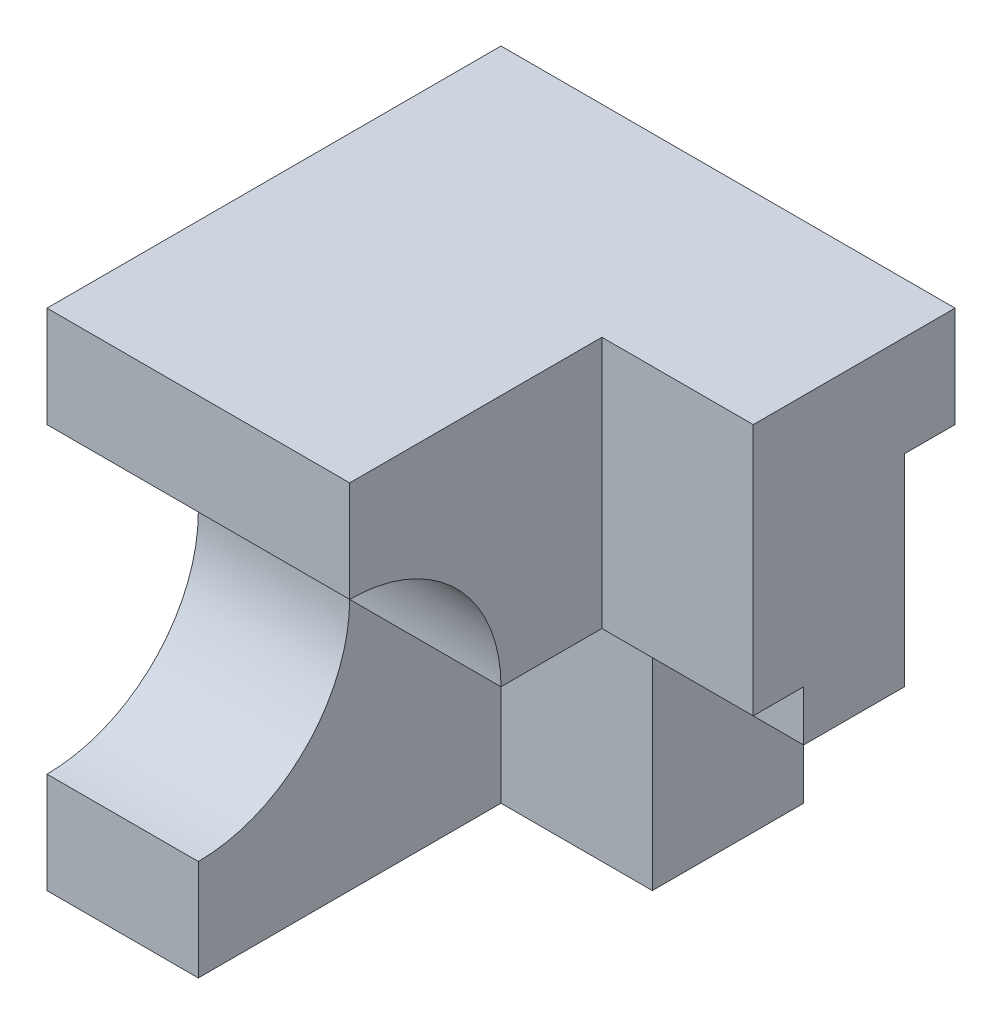
ISO-10303-21;
HEADER;
FILE_DESCRIPTION(('STEP AP214'),'2;1');
FILE_NAME('part.step','',(''),(''),'','','');
FILE_SCHEMA(('AUTOMOTIVE_DESIGN { 1 0 10303 214 1 1 1 1 }'));
ENDSEC;
DATA;
#1=APPLICATION_CONTEXT('core data for automotive mechanical design processes');
#2=APPLICATION_PROTOCOL_DEFINITION('international standard','automotive_design',2000,#1);
#3=PRODUCT_CONTEXT('',#1,'mechanical');
#4=PRODUCT('Part','Part','',(#3));
#5=PRODUCT_RELATED_PRODUCT_CATEGORY('part','',(#4));
#6=PRODUCT_DEFINITION_FORMATION('','',#4);
#7=PRODUCT_DEFINITION_CONTEXT('part definition',#1,'design');
#8=PRODUCT_DEFINITION('design','',#6,#7);
#9=PRODUCT_DEFINITION_SHAPE('','',#8);
#10=(LENGTH_UNIT() NAMED_UNIT(*) SI_UNIT(.MILLI.,.METRE.));
#11=(NAMED_UNIT(*) PLANE_ANGLE_UNIT() SI_UNIT($,.RADIAN.));
#12=(NAMED_UNIT(*) SI_UNIT($,.STERADIAN.) SOLID_ANGLE_UNIT());
#13=UNCERTAINTY_MEASURE_WITH_UNIT(LENGTH_MEASURE(1.E-05),#10,'distance_accuracy_value','');
#14=(GEOMETRIC_REPRESENTATION_CONTEXT(3) GLOBAL_UNCERTAINTY_ASSIGNED_CONTEXT((#13)) GLOBAL_UNIT_ASSIGNED_CONTEXT((#10,
#11,#12)) REPRESENTATION_CONTEXT('',''));
#15=CARTESIAN_POINT('',(0.,0.,0.));
#16=DIRECTION('',(0.,0.,1.));
#17=DIRECTION('',(1.,0.,0.));
#18=AXIS2_PLACEMENT_3D('',#15,#16,#17);
#19=CARTESIAN_POINT('',(9.,0.,-4.5));
#20=DIRECTION('',(0.,0.,1.));
#21=DIRECTION('',(1.,0.,0.));
#22=AXIS2_PLACEMENT_3D('',#19,#20,#21);
#23=PLANE('',#22);
#24=DIRECTION('',(0.,1.,0.));
#25=VECTOR('',#24,1.);
#26=CARTESIAN_POINT('',(6.,0.,-4.5));
#27=LINE('',#26,#25);
#28=CARTESIAN_POINT('',(6.,-5.,-4.5));
#29=VERTEX_POINT('',#28);
#30=CARTESIAN_POINT('',(6.,-3.,-4.5));
#31=VERTEX_POINT('',#30);
#32=EDGE_CURVE('E251',#29,#31,#27,.T.);
#33=ORIENTED_EDGE('',*,*,#32,.F.);
#34=DIRECTION('',(-1.,0.,0.));
#35=VECTOR('',#34,1.);
#36=CARTESIAN_POINT('',(9.,-5.,-4.5));
#37=LINE('',#36,#35);
#38=CARTESIAN_POINT('',(0.,-5.,-4.5));
#39=VERTEX_POINT('',#38);
#40=EDGE_CURVE('E193',#29,#39,#37,.T.);
#41=ORIENTED_EDGE('',*,*,#40,.T.);
#42=DIRECTION('',(0.,1.,0.));
#43=VECTOR('',#42,1.);
#44=CARTESIAN_POINT('',(0.,0.,-4.5));
#45=LINE('',#44,#43);
#46=CARTESIAN_POINT('',(0.,-3.,-4.5));
#47=VERTEX_POINT('',#46);
#48=EDGE_CURVE('E223',#39,#47,#45,.T.);
#49=ORIENTED_EDGE('',*,*,#48,.T.);
#50=DIRECTION('',(-1.,0.,0.));
#51=VECTOR('',#50,1.);
#52=CARTESIAN_POINT('',(9.,-3.,-4.5));
#53=LINE('',#52,#51);
#54=EDGE_CURVE('E194',#31,#47,#53,.T.);
#55=ORIENTED_EDGE('',*,*,#54,.F.);
#56=EDGE_LOOP('',(#33,#41,#49,#55));
#57=FACE_BOUND('',#56,.T.);
#58=ADVANCED_FACE('F35',(#57),#23,.F.);
#59=CARTESIAN_POINT('',(9.,-2.99999999999999,0.));
#60=DIRECTION('',(0.,-1.,0.));
#61=DIRECTION('',(0.,0.,-1.));
#62=AXIS2_PLACEMENT_3D('',#59,#60,#61);
#63=PLANE('',#62);
#64=DIRECTION('',(0.,0.,1.));
#65=VECTOR('',#64,1.);
#66=CARTESIAN_POINT('',(6.,-2.99999999999999,0.));
#67=LINE('',#66,#65);
#68=CARTESIAN_POINT('',(6.,-3.,-3.5));
#69=VERTEX_POINT('',#68);
#70=EDGE_CURVE('E249',#31,#69,#67,.T.);
#71=ORIENTED_EDGE('',*,*,#70,.F.);
#72=ORIENTED_EDGE('',*,*,#54,.T.);
#73=DIRECTION('',(0.,0.,1.));
#74=VECTOR('',#73,1.);
#75=CARTESIAN_POINT('',(0.,-2.99999999999999,0.));
#76=LINE('',#75,#74);
#77=CARTESIAN_POINT('',(0.,-3.,-3.5));
#78=VERTEX_POINT('',#77);
#79=EDGE_CURVE('E220',#47,#78,#76,.T.);
#80=ORIENTED_EDGE('',*,*,#79,.T.);
#81=DIRECTION('',(-1.,0.,0.));
#82=VECTOR('',#81,1.);
#83=CARTESIAN_POINT('',(9.,-3.,-3.5));
#84=LINE('',#83,#82);
#85=EDGE_CURVE('E198',#69,#78,#84,.T.);
#86=ORIENTED_EDGE('',*,*,#85,.F.);
#87=EDGE_LOOP('',(#71,#72,#80,#86));
#88=FACE_BOUND('',#87,.T.);
#89=ADVANCED_FACE('F321',(#88),#63,.F.);
#90=CARTESIAN_POINT('',(9.,0.,-3.5));
#91=DIRECTION('',(0.,0.,1.));
#92=DIRECTION('',(1.,0.,0.));
#93=AXIS2_PLACEMENT_3D('',#90,#91,#92);
#94=PLANE('',#93);
#95=DIRECTION('',(1.,0.,0.));
#96=VECTOR('',#95,1.);
#97=CARTESIAN_POINT('',(6.,-1.,-3.5));
#98=LINE('',#97,#96);
#99=CARTESIAN_POINT('',(6.,-1.,-3.5));
#100=VERTEX_POINT('',#99);
#101=CARTESIAN_POINT('',(9.,-1.,-3.5));
#102=VERTEX_POINT('',#101);
#103=EDGE_CURVE('E240',#100,#102,#98,.T.);
#104=ORIENTED_EDGE('',*,*,#103,.F.);
#105=DIRECTION('',(0.,1.,0.));
#106=VECTOR('',#105,1.);
#107=CARTESIAN_POINT('',(6.,0.,-3.5));
#108=LINE('',#107,#106);
#109=EDGE_CURVE('E241',#69,#100,#108,.T.);
#110=ORIENTED_EDGE('',*,*,#109,.F.);
#111=ORIENTED_EDGE('',*,*,#85,.T.);
#112=DIRECTION('',(0.,1.,0.));
#113=VECTOR('',#112,1.);
#114=CARTESIAN_POINT('',(0.,0.,-3.5));
#115=LINE('',#114,#113);
#116=CARTESIAN_POINT('',(0.,3.,-3.5));
#117=VERTEX_POINT('',#116);
#118=EDGE_CURVE('E217',#78,#117,#115,.T.);
#119=ORIENTED_EDGE('',*,*,#118,.T.);
#120=DIRECTION('',(-1.,0.,0.));
#121=VECTOR('',#120,1.);
#122=CARTESIAN_POINT('',(9.,3.,-3.5));
#123=LINE('',#122,#121);
#124=CARTESIAN_POINT('',(9.,3.,-3.5));
#125=VERTEX_POINT('',#124);
#126=EDGE_CURVE('E200',#125,#117,#123,.T.);
#127=ORIENTED_EDGE('',*,*,#126,.F.);
#128=DIRECTION('',(0.,1.,0.));
#129=VECTOR('',#128,1.);
#130=CARTESIAN_POINT('',(9.,0.,-3.5));
#131=LINE('',#130,#129);
#132=EDGE_CURVE('E100',#102,#125,#131,.T.);
#133=ORIENTED_EDGE('',*,*,#132,.F.);
#134=EDGE_LOOP('',(#104,#110,#111,#119,#127,#133));
#135=FACE_BOUND('',#134,.T.);
#136=ADVANCED_FACE('F325',(#135),#94,.F.);
#137=CARTESIAN_POINT('',(9.,0.,4.5));
#138=DIRECTION('',(0.,0.,1.));
#139=DIRECTION('',(1.,0.,0.));
#140=AXIS2_PLACEMENT_3D('',#137,#138,#139);
#141=PLANE('',#140);
#142=DIRECTION('',(-1.,0.,0.));
#143=VECTOR('',#142,1.);
#144=CARTESIAN_POINT('',(9.,3.,4.5));
#145=LINE('',#144,#143);
#146=CARTESIAN_POINT('',(6.,3.,4.5));
#147=VERTEX_POINT('',#146);
#148=CARTESIAN_POINT('',(0.,3.,4.5));
#149=VERTEX_POINT('',#148);
#150=EDGE_CURVE('E95',#147,#149,#145,.T.);
#151=ORIENTED_EDGE('',*,*,#150,.F.);
#152=DIRECTION('',(0.,-1.,0.));
#153=VECTOR('',#152,1.);
#154=CARTESIAN_POINT('',(6.,0.,4.5));
#155=LINE('',#154,#153);
#156=CARTESIAN_POINT('',(6.,5.,4.5));
#157=VERTEX_POINT('',#156);
#158=EDGE_CURVE('E269',#157,#147,#155,.T.);
#159=ORIENTED_EDGE('',*,*,#158,.F.);
#160=DIRECTION('',(-1.,0.,0.));
#161=VECTOR('',#160,1.);
#162=CARTESIAN_POINT('',(9.,5.,4.5));
#163=LINE('',#162,#161);
#164=CARTESIAN_POINT('',(0.,5.,4.5));
#165=VERTEX_POINT('',#164);
#166=EDGE_CURVE('E88',#157,#165,#163,.T.);
#167=ORIENTED_EDGE('',*,*,#166,.T.);
#168=DIRECTION('',(0.,1.,0.));
#169=VECTOR('',#168,1.);
#170=CARTESIAN_POINT('',(0.,0.,4.5));
#171=LINE('',#170,#169);
#172=EDGE_CURVE('E212',#149,#165,#171,.T.);
#173=ORIENTED_EDGE('',*,*,#172,.F.);
#174=EDGE_LOOP('',(#151,#159,#167,#173));
#175=FACE_BOUND('',#174,.T.);
#176=ADVANCED_FACE('F299',(#175),#141,.T.);
#177=CARTESIAN_POINT('',(9.,0.,0.));
#178=DIRECTION('',(1.,0.,0.));
#179=DIRECTION('',(0.,0.,-1.));
#180=AXIS2_PLACEMENT_3D('',#177,#178,#179);
#181=PLANE('',#180);
#182=DIRECTION('',(0.,0.,1.));
#183=VECTOR('',#182,1.);
#184=CARTESIAN_POINT('',(9.,0.,4.5));
#185=LINE('',#184,#183);
#186=CARTESIAN_POINT('',(9.,0.,-1.5));
#187=VERTEX_POINT('',#186);
#188=CARTESIAN_POINT('',(9.,0.,-0.500000000000001));
#189=VERTEX_POINT('',#188);
#190=EDGE_CURVE('E179',#187,#189,#185,.T.);
#191=ORIENTED_EDGE('',*,*,#190,.F.);
#192=DIRECTION('',(0.,1.,0.));
#193=VECTOR('',#192,1.);
#194=CARTESIAN_POINT('',(9.,-5.,-1.5));
#195=LINE('',#194,#193);
#196=CARTESIAN_POINT('',(9.,-1.,-1.5));
#197=VERTEX_POINT('',#196);
#198=EDGE_CURVE('E287',#197,#187,#195,.T.);
#199=ORIENTED_EDGE('',*,*,#198,.F.);
#200=DIRECTION('',(0.,0.,-1.));
#201=VECTOR('',#200,1.);
#202=CARTESIAN_POINT('',(9.,-1.,0.));
#203=LINE('',#202,#201);
#204=EDGE_CURVE('E244',#197,#102,#203,.T.);
#205=ORIENTED_EDGE('',*,*,#204,.T.);
#206=ORIENTED_EDGE('',*,*,#132,.T.);
#207=DIRECTION('',(0.,0.,1.));
#208=VECTOR('',#207,1.);
#209=CARTESIAN_POINT('',(9.,3.,0.));
#210=LINE('',#209,#208);
#211=CARTESIAN_POINT('',(9.,3.,-4.5));
#212=VERTEX_POINT('',#211);
#213=EDGE_CURVE('E233',#212,#125,#210,.T.);
#214=ORIENTED_EDGE('',*,*,#213,.F.);
#215=DIRECTION('',(0.,1.,0.));
#216=VECTOR('',#215,1.);
#217=CARTESIAN_POINT('',(9.,0.,-4.5));
#218=LINE('',#217,#216);
#219=CARTESIAN_POINT('',(9.,5.,-4.5));
#220=VERTEX_POINT('',#219);
#221=EDGE_CURVE('E52',#212,#220,#218,.T.);
#222=ORIENTED_EDGE('',*,*,#221,.T.);
#223=DIRECTION('',(0.,0.,1.));
#224=VECTOR('',#223,1.);
#225=CARTESIAN_POINT('',(9.,5.,0.));
#226=LINE('',#225,#224);
#227=CARTESIAN_POINT('',(9.,5.,-0.500000000000001));
#228=VERTEX_POINT('',#227);
#229=EDGE_CURVE('E209',#220,#228,#226,.T.);
#230=ORIENTED_EDGE('',*,*,#229,.T.);
#231=DIRECTION('',(0.,1.,0.));
#232=VECTOR('',#231,1.);
#233=CARTESIAN_POINT('',(9.,0.,-0.500000000000001));
#234=LINE('',#233,#232);
#235=EDGE_CURVE('E243',#189,#228,#234,.T.);
#236=ORIENTED_EDGE('',*,*,#235,.F.);
#237=EDGE_LOOP('',(#191,#199,#205,#206,#214,#222,#230,#236));
#238=FACE_BOUND('',#237,.T.);
#239=ADVANCED_FACE('F332',(#238),#181,.T.);
#240=CARTESIAN_POINT('',(9.,0.,4.5));
#241=DIRECTION('',(-1.,0.,0.));
#242=DIRECTION('',(0.,0.,1.));
#243=AXIS2_PLACEMENT_3D('',#240,#241,#242);
#244=CYLINDRICAL_SURFACE('',#243,3.);
#245=DIRECTION('',(-1.,0.,0.));
#246=VECTOR('',#245,1.);
#247=CARTESIAN_POINT('',(9.,0.,1.5));
#248=LINE('',#247,#246);
#249=CARTESIAN_POINT('',(6.,0.,1.5));
#250=VERTEX_POINT('',#249);
#251=CARTESIAN_POINT('',(3.,0.,1.5));
#252=VERTEX_POINT('',#251);
#253=EDGE_CURVE('E279',#250,#252,#248,.T.);
#254=ORIENTED_EDGE('',*,*,#253,.F.);
#255=CARTESIAN_POINT('',(6.,0.,4.5));
#256=DIRECTION('',(1.,0.,0.));
#257=DIRECTION('',(0.,0.,-1.));
#258=AXIS2_PLACEMENT_3D('',#255,#256,#257);
#259=CIRCLE('',#258,3.);
#260=EDGE_CURVE('E262',#147,#250,#259,.F.);
#261=ORIENTED_EDGE('',*,*,#260,.F.);
#262=ORIENTED_EDGE('',*,*,#150,.T.);
#263=CARTESIAN_POINT('',(0.,0.,4.5));
#264=DIRECTION('',(1.,0.,0.));
#265=DIRECTION('',(0.,0.,-1.));
#266=AXIS2_PLACEMENT_3D('',#263,#264,#265);
#267=CIRCLE('',#266,3.);
#268=CARTESIAN_POINT('',(0.,-3.,4.5));
#269=VERTEX_POINT('',#268);
#270=EDGE_CURVE('E229',#269,#149,#267,.T.);
#271=ORIENTED_EDGE('',*,*,#270,.F.);
#272=DIRECTION('',(-1.,0.,0.));
#273=VECTOR('',#272,1.);
#274=CARTESIAN_POINT('',(9.,-3.,4.5));
#275=LINE('',#274,#273);
#276=CARTESIAN_POINT('',(3.,-3.,4.5));
#277=VERTEX_POINT('',#276);
#278=EDGE_CURVE('E11',#277,#269,#275,.T.);
#279=ORIENTED_EDGE('',*,*,#278,.F.);
#280=CARTESIAN_POINT('',(3.,0.,4.5));
#281=DIRECTION('',(-1.,0.,0.));
#282=DIRECTION('',(0.,0.,1.));
#283=AXIS2_PLACEMENT_3D('',#280,#281,#282);
#284=CIRCLE('',#283,3.);
#285=EDGE_CURVE('E175',#252,#277,#284,.T.);
#286=ORIENTED_EDGE('',*,*,#285,.F.);
#287=EDGE_LOOP('',(#254,#261,#262,#271,#279,#286));
#288=FACE_BOUND('',#287,.T.);
#289=ADVANCED_FACE('F37',(#288),#244,.F.);
#290=DIRECTION('',(0.,-1.,0.));
#291=VECTOR('',#290,1.);
#292=CARTESIAN_POINT('',(3.,-5.,4.5));
#293=LINE('',#292,#291);
#294=CARTESIAN_POINT('',(3.,-5.,4.5));
#295=VERTEX_POINT('',#294);
#296=EDGE_CURVE('E167',#277,#295,#293,.T.);
#297=ORIENTED_EDGE('',*,*,#296,.F.);
#298=ORIENTED_EDGE('',*,*,#278,.T.);
#299=CARTESIAN_POINT('',(0.,-5.,4.5));
#300=VERTEX_POINT('',#299);
#301=EDGE_CURVE('E191',#300,#269,#171,.T.);
#302=ORIENTED_EDGE('',*,*,#301,.F.);
#303=DIRECTION('',(-1.,0.,0.));
#304=VECTOR('',#303,1.);
#305=CARTESIAN_POINT('',(9.,-5.,4.5));
#306=LINE('',#305,#304);
#307=EDGE_CURVE('E44',#295,#300,#306,.T.);
#308=ORIENTED_EDGE('',*,*,#307,.F.);
#309=EDGE_LOOP('',(#297,#298,#302,#308));
#310=FACE_BOUND('',#309,.T.);
#311=ADVANCED_FACE('F189',(#310),#141,.T.);
#312=CARTESIAN_POINT('',(9.,-5.,0.));
#313=DIRECTION('',(0.,-1.,0.));
#314=DIRECTION('',(0.,0.,-1.));
#315=AXIS2_PLACEMENT_3D('',#312,#313,#314);
#316=PLANE('',#315);
#317=DIRECTION('',(1.,0.,0.));
#318=VECTOR('',#317,1.);
#319=CARTESIAN_POINT('',(3.,-5.,-1.5));
#320=LINE('',#319,#318);
#321=CARTESIAN_POINT('',(3.,-5.,-1.5));
#322=VERTEX_POINT('',#321);
#323=CARTESIAN_POINT('',(6.,-5.,-1.5));
#324=VERTEX_POINT('',#323);
#325=EDGE_CURVE('E186',#322,#324,#320,.T.);
#326=ORIENTED_EDGE('',*,*,#325,.F.);
#327=DIRECTION('',(0.,0.,-1.));
#328=VECTOR('',#327,1.);
#329=CARTESIAN_POINT('',(3.,-5.,4.5));
#330=LINE('',#329,#328);
#331=EDGE_CURVE('E171',#295,#322,#330,.T.);
#332=ORIENTED_EDGE('',*,*,#331,.F.);
#333=ORIENTED_EDGE('',*,*,#307,.T.);
#334=DIRECTION('',(0.,0.,1.));
#335=VECTOR('',#334,1.);
#336=CARTESIAN_POINT('',(0.,-5.,0.));
#337=LINE('',#336,#335);
#338=EDGE_CURVE('E226',#39,#300,#337,.T.);
#339=ORIENTED_EDGE('',*,*,#338,.F.);
#340=ORIENTED_EDGE('',*,*,#40,.F.);
#341=DIRECTION('',(0.,0.,-1.));
#342=VECTOR('',#341,1.);
#343=CARTESIAN_POINT('',(6.,-5.,0.));
#344=LINE('',#343,#342);
#345=EDGE_CURVE('E253',#324,#29,#344,.T.);
#346=ORIENTED_EDGE('',*,*,#345,.F.);
#347=EDGE_LOOP('',(#326,#332,#333,#339,#340,#346));
#348=FACE_BOUND('',#347,.T.);
#349=ADVANCED_FACE('F182',(#348),#316,.T.);
#350=CARTESIAN_POINT('',(9.,3.,0.));
#351=DIRECTION('',(0.,-1.,0.));
#352=DIRECTION('',(0.,0.,-1.));
#353=AXIS2_PLACEMENT_3D('',#350,#351,#352);
#354=PLANE('',#353);
#355=DIRECTION('',(0.,0.,1.));
#356=VECTOR('',#355,1.);
#357=CARTESIAN_POINT('',(0.,3.,0.));
#358=LINE('',#357,#356);
#359=CARTESIAN_POINT('',(0.,3.,-4.5));
#360=VERTEX_POINT('',#359);
#361=EDGE_CURVE('E214',#360,#117,#358,.T.);
#362=ORIENTED_EDGE('',*,*,#361,.F.);
#363=DIRECTION('',(-1.,0.,0.));
#364=VECTOR('',#363,1.);
#365=CARTESIAN_POINT('',(9.,3.,-4.5));
#366=LINE('',#365,#364);
#367=EDGE_CURVE('E202',#212,#360,#366,.T.);
#368=ORIENTED_EDGE('',*,*,#367,.F.);
#369=ORIENTED_EDGE('',*,*,#213,.T.);
#370=ORIENTED_EDGE('',*,*,#126,.T.);
#371=EDGE_LOOP('',(#362,#368,#369,#370));
#372=FACE_BOUND('',#371,.T.);
#373=ADVANCED_FACE('F355',(#372),#354,.T.);
#374=CARTESIAN_POINT('',(0.,5.,-4.5));
#375=VERTEX_POINT('',#374);
#376=EDGE_CURVE('E213',#360,#375,#45,.T.);
#377=ORIENTED_EDGE('',*,*,#376,.T.);
#378=DIRECTION('',(-1.,0.,0.));
#379=VECTOR('',#378,1.);
#380=CARTESIAN_POINT('',(9.,5.,-4.5));
#381=LINE('',#380,#379);
#382=EDGE_CURVE('E204',#220,#375,#381,.T.);
#383=ORIENTED_EDGE('',*,*,#382,.F.);
#384=ORIENTED_EDGE('',*,*,#221,.F.);
#385=ORIENTED_EDGE('',*,*,#367,.T.);
#386=EDGE_LOOP('',(#377,#383,#384,#385));
#387=FACE_BOUND('',#386,.T.);
#388=ADVANCED_FACE('F347',(#387),#23,.F.);
#389=CARTESIAN_POINT('',(9.,5.,0.));
#390=DIRECTION('',(0.,-1.,0.));
#391=DIRECTION('',(0.,0.,-1.));
#392=AXIS2_PLACEMENT_3D('',#389,#390,#391);
#393=PLANE('',#392);
#394=DIRECTION('',(0.,0.,1.));
#395=VECTOR('',#394,1.);
#396=CARTESIAN_POINT('',(6.,5.,0.));
#397=LINE('',#396,#395);
#398=CARTESIAN_POINT('',(6.,5.,-0.500000000000001));
#399=VERTEX_POINT('',#398);
#400=EDGE_CURVE('E271',#399,#157,#397,.T.);
#401=ORIENTED_EDGE('',*,*,#400,.F.);
#402=DIRECTION('',(1.,0.,0.));
#403=VECTOR('',#402,1.);
#404=CARTESIAN_POINT('',(6.,5.,-0.500000000000001));
#405=LINE('',#404,#403);
#406=EDGE_CURVE('E231',#399,#228,#405,.T.);
#407=ORIENTED_EDGE('',*,*,#406,.T.);
#408=ORIENTED_EDGE('',*,*,#229,.F.);
#409=ORIENTED_EDGE('',*,*,#382,.T.);
#410=DIRECTION('',(0.,0.,1.));
#411=VECTOR('',#410,1.);
#412=CARTESIAN_POINT('',(0.,5.,0.));
#413=LINE('',#412,#411);
#414=EDGE_CURVE('E210',#375,#165,#413,.T.);
#415=ORIENTED_EDGE('',*,*,#414,.T.);
#416=ORIENTED_EDGE('',*,*,#166,.F.);
#417=EDGE_LOOP('',(#401,#407,#408,#409,#415,#416));
#418=FACE_BOUND('',#417,.T.);
#419=ADVANCED_FACE('F301',(#418),#393,.F.);
#420=CARTESIAN_POINT('',(0.,0.,0.));
#421=DIRECTION('',(1.,0.,0.));
#422=DIRECTION('',(0.,0.,-1.));
#423=AXIS2_PLACEMENT_3D('',#420,#421,#422);
#424=PLANE('',#423);
#425=ORIENTED_EDGE('',*,*,#270,.T.);
#426=ORIENTED_EDGE('',*,*,#172,.T.);
#427=ORIENTED_EDGE('',*,*,#414,.F.);
#428=ORIENTED_EDGE('',*,*,#376,.F.);
#429=ORIENTED_EDGE('',*,*,#361,.T.);
#430=ORIENTED_EDGE('',*,*,#118,.F.);
#431=ORIENTED_EDGE('',*,*,#79,.F.);
#432=ORIENTED_EDGE('',*,*,#48,.F.);
#433=ORIENTED_EDGE('',*,*,#338,.T.);
#434=ORIENTED_EDGE('',*,*,#301,.T.);
#435=EDGE_LOOP('',(#425,#426,#427,#428,#429,#430,#431,#432,#433,#434));
#436=FACE_BOUND('',#435,.T.);
#437=ADVANCED_FACE('F307',(#436),#424,.F.);
#438=CARTESIAN_POINT('',(6.,-1.,0.));
#439=DIRECTION('',(0.,-1.,0.));
#440=DIRECTION('',(0.,0.,-1.));
#441=AXIS2_PLACEMENT_3D('',#438,#439,#440);
#442=PLANE('',#441);
#443=ORIENTED_EDGE('',*,*,#204,.F.);
#444=DIRECTION('',(1.,0.,0.));
#445=VECTOR('',#444,1.);
#446=CARTESIAN_POINT('',(6.,-1.,-1.5));
#447=LINE('',#446,#445);
#448=CARTESIAN_POINT('',(6.,-1.,-1.5));
#449=VERTEX_POINT('',#448);
#450=EDGE_CURVE('E238',#449,#197,#447,.T.);
#451=ORIENTED_EDGE('',*,*,#450,.F.);
#452=DIRECTION('',(0.,0.,-1.));
#453=VECTOR('',#452,1.);
#454=CARTESIAN_POINT('',(6.,-1.,0.));
#455=LINE('',#454,#453);
#456=EDGE_CURVE('E246',#449,#100,#455,.T.);
#457=ORIENTED_EDGE('',*,*,#456,.T.);
#458=ORIENTED_EDGE('',*,*,#103,.T.);
#459=EDGE_LOOP('',(#443,#451,#457,#458));
#460=FACE_BOUND('',#459,.T.);
#461=ADVANCED_FACE('F329',(#460),#442,.T.);
#462=CARTESIAN_POINT('',(6.,0.,0.));
#463=DIRECTION('',(1.,0.,0.));
#464=DIRECTION('',(0.,0.,-1.));
#465=AXIS2_PLACEMENT_3D('',#462,#463,#464);
#466=PLANE('',#465);
#467=ORIENTED_EDGE('',*,*,#456,.F.);
#468=DIRECTION('',(0.,-1.,0.));
#469=VECTOR('',#468,1.);
#470=CARTESIAN_POINT('',(6.,0.,-1.5));
#471=LINE('',#470,#469);
#472=EDGE_CURVE('E255',#449,#324,#471,.T.);
#473=ORIENTED_EDGE('',*,*,#472,.T.);
#474=ORIENTED_EDGE('',*,*,#345,.T.);
#475=ORIENTED_EDGE('',*,*,#32,.T.);
#476=ORIENTED_EDGE('',*,*,#70,.T.);
#477=ORIENTED_EDGE('',*,*,#109,.T.);
#478=EDGE_LOOP('',(#467,#473,#474,#475,#476,#477));
#479=FACE_BOUND('',#478,.T.);
#480=ADVANCED_FACE('F317',(#479),#466,.T.);
#481=CARTESIAN_POINT('',(6.,0.,-0.500000000000001));
#482=DIRECTION('',(0.,0.,-1.));
#483=DIRECTION('',(-1.,0.,0.));
#484=AXIS2_PLACEMENT_3D('',#481,#482,#483);
#485=PLANE('',#484);
#486=ORIENTED_EDGE('',*,*,#235,.T.);
#487=ORIENTED_EDGE('',*,*,#406,.F.);
#488=DIRECTION('',(0.,1.,0.));
#489=VECTOR('',#488,1.);
#490=CARTESIAN_POINT('',(6.,0.,-0.500000000000001));
#491=LINE('',#490,#489);
#492=CARTESIAN_POINT('',(6.,0.,-0.500000000000001));
#493=VERTEX_POINT('',#492);
#494=EDGE_CURVE('E273',#493,#399,#491,.T.);
#495=ORIENTED_EDGE('',*,*,#494,.F.);
#496=DIRECTION('',(1.,0.,0.));
#497=VECTOR('',#496,1.);
#498=CARTESIAN_POINT('',(6.,0.,-0.500000000000001));
#499=LINE('',#498,#497);
#500=EDGE_CURVE('E259',#493,#189,#499,.T.);
#501=ORIENTED_EDGE('',*,*,#500,.T.);
#502=EDGE_LOOP('',(#486,#487,#495,#501));
#503=FACE_BOUND('',#502,.T.);
#504=ADVANCED_FACE('F336',(#503),#485,.F.);
#505=CARTESIAN_POINT('',(6.,0.,0.));
#506=DIRECTION('',(1.,0.,0.));
#507=DIRECTION('',(0.,0.,-1.));
#508=AXIS2_PLACEMENT_3D('',#505,#506,#507);
#509=PLANE('',#508);
#510=DIRECTION('',(0.,0.,-1.));
#511=VECTOR('',#510,1.);
#512=CARTESIAN_POINT('',(6.,0.,0.));
#513=LINE('',#512,#511);
#514=EDGE_CURVE('E266',#250,#493,#513,.T.);
#515=ORIENTED_EDGE('',*,*,#514,.T.);
#516=ORIENTED_EDGE('',*,*,#494,.T.);
#517=ORIENTED_EDGE('',*,*,#400,.T.);
#518=ORIENTED_EDGE('',*,*,#158,.T.);
#519=ORIENTED_EDGE('',*,*,#260,.T.);
#520=EDGE_LOOP('',(#515,#516,#517,#518,#519));
#521=FACE_BOUND('',#520,.T.);
#522=ADVANCED_FACE('F297',(#521),#509,.T.);
#523=CARTESIAN_POINT('',(3.,0.,4.5));
#524=DIRECTION('',(0.,1.,0.));
#525=DIRECTION('',(0.,0.,1.));
#526=AXIS2_PLACEMENT_3D('',#523,#524,#525);
#527=PLANE('',#526);
#528=ORIENTED_EDGE('',*,*,#253,.T.);
#529=DIRECTION('',(0.,0.,1.));
#530=VECTOR('',#529,1.);
#531=CARTESIAN_POINT('',(3.,0.,4.5));
#532=LINE('',#531,#530);
#533=CARTESIAN_POINT('',(3.,0.,-1.5));
#534=VERTEX_POINT('',#533);
#535=EDGE_CURVE('E283',#534,#252,#532,.T.);
#536=ORIENTED_EDGE('',*,*,#535,.F.);
#537=DIRECTION('',(1.,0.,0.));
#538=VECTOR('',#537,1.);
#539=CARTESIAN_POINT('',(3.,0.,-1.5));
#540=LINE('',#539,#538);
#541=EDGE_CURVE('E281',#534,#187,#540,.T.);
#542=ORIENTED_EDGE('',*,*,#541,.T.);
#543=ORIENTED_EDGE('',*,*,#190,.T.);
#544=ORIENTED_EDGE('',*,*,#500,.F.);
#545=ORIENTED_EDGE('',*,*,#514,.F.);
#546=EDGE_LOOP('',(#528,#536,#542,#543,#544,#545));
#547=FACE_BOUND('',#546,.T.);
#548=ADVANCED_FACE('F293',(#547),#527,.F.);
#549=CARTESIAN_POINT('',(3.,-5.,-1.5));
#550=DIRECTION('',(0.,0.,-1.));
#551=DIRECTION('',(-1.,0.,0.));
#552=AXIS2_PLACEMENT_3D('',#549,#550,#551);
#553=PLANE('',#552);
#554=ORIENTED_EDGE('',*,*,#450,.T.);
#555=ORIENTED_EDGE('',*,*,#198,.T.);
#556=ORIENTED_EDGE('',*,*,#541,.F.);
#557=DIRECTION('',(0.,1.,0.));
#558=VECTOR('',#557,1.);
#559=CARTESIAN_POINT('',(3.,-5.,-1.5));
#560=LINE('',#559,#558);
#561=EDGE_CURVE('E187',#322,#534,#560,.T.);
#562=ORIENTED_EDGE('',*,*,#561,.F.);
#563=ORIENTED_EDGE('',*,*,#325,.T.);
#564=ORIENTED_EDGE('',*,*,#472,.F.);
#565=EDGE_LOOP('',(#554,#555,#556,#562,#563,#564));
#566=FACE_BOUND('',#565,.T.);
#567=ADVANCED_FACE('F331',(#566),#553,.F.);
#568=CARTESIAN_POINT('',(3.,0.,0.));
#569=DIRECTION('',(-1.,0.,0.));
#570=DIRECTION('',(0.,0.,1.));
#571=AXIS2_PLACEMENT_3D('',#568,#569,#570);
#572=PLANE('',#571);
#573=ORIENTED_EDGE('',*,*,#285,.T.);
#574=ORIENTED_EDGE('',*,*,#296,.T.);
#575=ORIENTED_EDGE('',*,*,#331,.T.);
#576=ORIENTED_EDGE('',*,*,#561,.T.);
#577=ORIENTED_EDGE('',*,*,#535,.T.);
#578=EDGE_LOOP('',(#573,#574,#575,#576,#577));
#579=FACE_BOUND('',#578,.T.);
#580=ADVANCED_FACE('F169',(#579),#572,.F.);
#581=CLOSED_SHELL('',(#58,#89,#136,#176,#239,#289,#311,#349,#373,#388,#419,#437,#461,#480,#504,
#522,#548,#567,#580));
#582=MANIFOLD_SOLID_BREP('B2',#581);
#583=ADVANCED_BREP_SHAPE_REPRESENTATION('',(#18,#582),#14);
#584=SHAPE_DEFINITION_REPRESENTATION(#9,#583);
ENDSEC;
END-ISO-10303-21;
